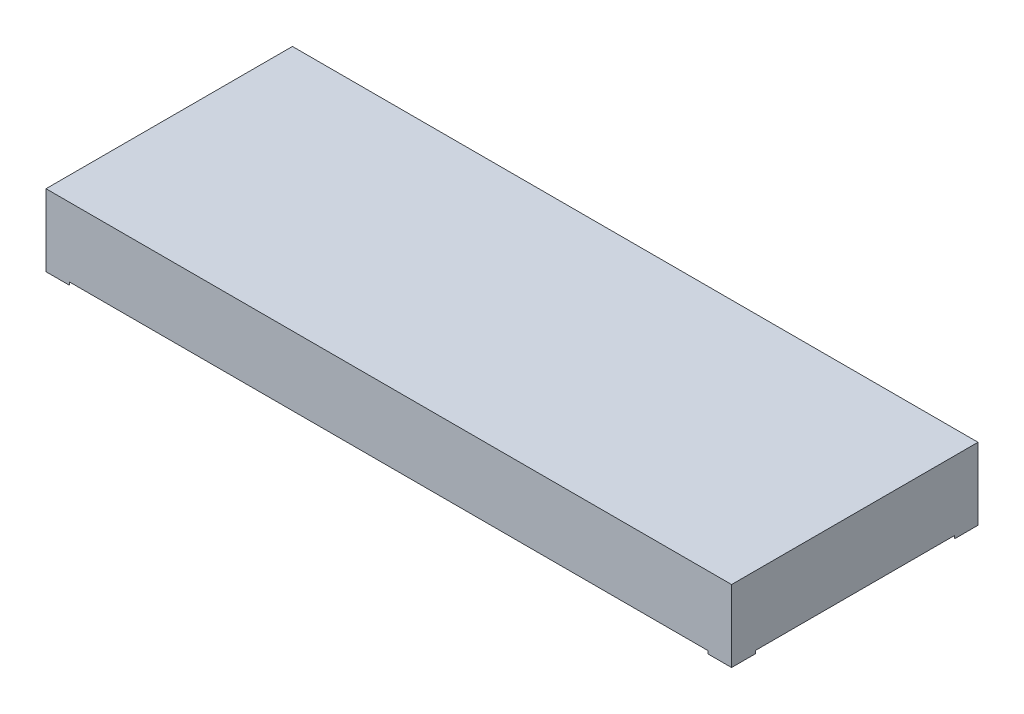
ISO-10303-21;
HEADER;
FILE_DESCRIPTION(('STEP AP214'),'2;1');
FILE_NAME('part.step','',(''),(''),'','','');
FILE_SCHEMA(('AUTOMOTIVE_DESIGN { 1 0 10303 214 1 1 1 1 }'));
ENDSEC;
DATA;
#1=APPLICATION_CONTEXT('core data for automotive mechanical design processes');
#2=APPLICATION_PROTOCOL_DEFINITION('international standard','automotive_design',2000,#1);
#3=PRODUCT_CONTEXT('',#1,'mechanical');
#4=PRODUCT('Part','Part','',(#3));
#5=PRODUCT_RELATED_PRODUCT_CATEGORY('part','',(#4));
#6=PRODUCT_DEFINITION_FORMATION('','',#4);
#7=PRODUCT_DEFINITION_CONTEXT('part definition',#1,'design');
#8=PRODUCT_DEFINITION('design','',#6,#7);
#9=PRODUCT_DEFINITION_SHAPE('','',#8);
#10=(LENGTH_UNIT() NAMED_UNIT(*) SI_UNIT(.MILLI.,.METRE.));
#11=(NAMED_UNIT(*) PLANE_ANGLE_UNIT() SI_UNIT($,.RADIAN.));
#12=(NAMED_UNIT(*) SI_UNIT($,.STERADIAN.) SOLID_ANGLE_UNIT());
#13=UNCERTAINTY_MEASURE_WITH_UNIT(LENGTH_MEASURE(1.E-05),#10,'distance_accuracy_value','');
#14=(GEOMETRIC_REPRESENTATION_CONTEXT(3) GLOBAL_UNCERTAINTY_ASSIGNED_CONTEXT((#13)) GLOBAL_UNIT_ASSIGNED_CONTEXT((#10,
#11,#12)) REPRESENTATION_CONTEXT('',''));
#15=CARTESIAN_POINT('',(0.,0.,0.));
#16=DIRECTION('',(0.,0.,1.));
#17=DIRECTION('',(1.,0.,0.));
#18=AXIS2_PLACEMENT_3D('',#15,#16,#17);
#19=CARTESIAN_POINT('',(0.,7.5,0.));
#20=DIRECTION('',(1.,0.,0.));
#21=DIRECTION('',(0.,0.,-1.));
#22=AXIS2_PLACEMENT_3D('',#19,#20,#21);
#23=PLANE('',#22);
#24=DIRECTION('',(0.,-1.,0.));
#25=VECTOR('',#24,1.);
#26=CARTESIAN_POINT('',(0.,0.3,2.47487373415291));
#27=LINE('',#26,#25);
#28=CARTESIAN_POINT('',(0.,0.3,2.47487373415291));
#29=VERTEX_POINT('',#28);
#30=CARTESIAN_POINT('',(0.,0.,2.47487373415291));
#31=VERTEX_POINT('',#30);
#32=EDGE_CURVE('E234',#29,#31,#27,.T.);
#33=ORIENTED_EDGE('',*,*,#32,.F.);
#34=DIRECTION('',(0.,0.,-1.));
#35=VECTOR('',#34,1.);
#36=CARTESIAN_POINT('',(0.,0.3,0.));
#37=LINE('',#36,#35);
#38=CARTESIAN_POINT('',(0.,0.3,23.2251262658471));
#39=VERTEX_POINT('',#38);
#40=EDGE_CURVE('E168',#39,#29,#37,.T.);
#41=ORIENTED_EDGE('',*,*,#40,.F.);
#42=DIRECTION('',(0.,-1.,0.));
#43=VECTOR('',#42,1.);
#44=CARTESIAN_POINT('',(0.,0.3,23.2251262658471));
#45=LINE('',#44,#43);
#46=CARTESIAN_POINT('',(0.,0.,23.2251262658471));
#47=VERTEX_POINT('',#46);
#48=EDGE_CURVE('E237',#39,#47,#45,.T.);
#49=ORIENTED_EDGE('',*,*,#48,.T.);
#50=DIRECTION('',(0.,0.,1.));
#51=VECTOR('',#50,1.);
#52=CARTESIAN_POINT('',(0.,0.,0.));
#53=LINE('',#52,#51);
#54=CARTESIAN_POINT('',(0.,0.,25.7));
#55=VERTEX_POINT('',#54);
#56=EDGE_CURVE('E188',#47,#55,#53,.T.);
#57=ORIENTED_EDGE('',*,*,#56,.T.);
#58=DIRECTION('',(0.,-1.,0.));
#59=VECTOR('',#58,1.);
#60=CARTESIAN_POINT('',(0.,7.5,25.7));
#61=LINE('',#60,#59);
#62=CARTESIAN_POINT('',(0.,7.5,25.7));
#63=VERTEX_POINT('',#62);
#64=EDGE_CURVE('E11',#63,#55,#61,.T.);
#65=ORIENTED_EDGE('',*,*,#64,.F.);
#66=DIRECTION('',(0.,0.,1.));
#67=VECTOR('',#66,1.);
#68=CARTESIAN_POINT('',(0.,7.5,0.));
#69=LINE('',#68,#67);
#70=CARTESIAN_POINT('',(0.,7.5,0.));
#71=VERTEX_POINT('',#70);
#72=EDGE_CURVE('E172',#71,#63,#69,.T.);
#73=ORIENTED_EDGE('',*,*,#72,.F.);
#74=DIRECTION('',(0.,-1.,0.));
#75=VECTOR('',#74,1.);
#76=CARTESIAN_POINT('',(0.,7.5,0.));
#77=LINE('',#76,#75);
#78=CARTESIAN_POINT('',(0.,0.,0.));
#79=VERTEX_POINT('',#78);
#80=EDGE_CURVE('E182',#71,#79,#77,.T.);
#81=ORIENTED_EDGE('',*,*,#80,.T.);
#82=EDGE_CURVE('E183',#79,#31,#53,.T.);
#83=ORIENTED_EDGE('',*,*,#82,.T.);
#84=EDGE_LOOP('',(#33,#41,#49,#57,#65,#73,#81,#83));
#85=FACE_BOUND('',#84,.T.);
#86=ADVANCED_FACE('F41',(#85),#23,.F.);
#87=CARTESIAN_POINT('',(71.5,7.5,0.));
#88=DIRECTION('',(-1.,0.,0.));
#89=DIRECTION('',(0.,0.,1.));
#90=AXIS2_PLACEMENT_3D('',#87,#88,#89);
#91=PLANE('',#90);
#92=DIRECTION('',(0.,-1.,0.));
#93=VECTOR('',#92,1.);
#94=CARTESIAN_POINT('',(71.5,0.3,23.2251262658471));
#95=LINE('',#94,#93);
#96=CARTESIAN_POINT('',(71.5,0.3,23.2251262658471));
#97=VERTEX_POINT('',#96);
#98=CARTESIAN_POINT('',(71.5,0.,23.2251262658471));
#99=VERTEX_POINT('',#98);
#100=EDGE_CURVE('E166',#97,#99,#95,.T.);
#101=ORIENTED_EDGE('',*,*,#100,.F.);
#102=DIRECTION('',(0.,0.,1.));
#103=VECTOR('',#102,1.);
#104=CARTESIAN_POINT('',(71.5,0.3,0.));
#105=LINE('',#104,#103);
#106=CARTESIAN_POINT('',(71.5,0.3,2.47487373415292));
#107=VERTEX_POINT('',#106);
#108=EDGE_CURVE('E146',#107,#97,#105,.T.);
#109=ORIENTED_EDGE('',*,*,#108,.F.);
#110=DIRECTION('',(0.,-1.,0.));
#111=VECTOR('',#110,1.);
#112=CARTESIAN_POINT('',(71.5,0.3,2.47487373415292));
#113=LINE('',#112,#111);
#114=CARTESIAN_POINT('',(71.5,0.,2.47487373415292));
#115=VERTEX_POINT('',#114);
#116=EDGE_CURVE('E141',#107,#115,#113,.T.);
#117=ORIENTED_EDGE('',*,*,#116,.T.);
#118=DIRECTION('',(0.,0.,-1.));
#119=VECTOR('',#118,1.);
#120=CARTESIAN_POINT('',(71.5,0.,0.));
#121=LINE('',#120,#119);
#122=CARTESIAN_POINT('',(71.5,0.,0.));
#123=VERTEX_POINT('',#122);
#124=EDGE_CURVE('E193',#115,#123,#121,.T.);
#125=ORIENTED_EDGE('',*,*,#124,.T.);
#126=DIRECTION('',(0.,-1.,0.));
#127=VECTOR('',#126,1.);
#128=CARTESIAN_POINT('',(71.5,7.5,0.));
#129=LINE('',#128,#127);
#130=CARTESIAN_POINT('',(71.5,7.5,0.));
#131=VERTEX_POINT('',#130);
#132=EDGE_CURVE('E202',#131,#123,#129,.T.);
#133=ORIENTED_EDGE('',*,*,#132,.F.);
#134=DIRECTION('',(0.,0.,-1.));
#135=VECTOR('',#134,1.);
#136=CARTESIAN_POINT('',(71.5,7.5,0.));
#137=LINE('',#136,#135);
#138=CARTESIAN_POINT('',(71.5,7.5,25.7));
#139=VERTEX_POINT('',#138);
#140=EDGE_CURVE('E177',#139,#131,#137,.T.);
#141=ORIENTED_EDGE('',*,*,#140,.F.);
#142=DIRECTION('',(0.,-1.,0.));
#143=VECTOR('',#142,1.);
#144=CARTESIAN_POINT('',(71.5,7.5,25.7));
#145=LINE('',#144,#143);
#146=CARTESIAN_POINT('',(71.5,0.,25.7));
#147=VERTEX_POINT('',#146);
#148=EDGE_CURVE('E49',#139,#147,#145,.T.);
#149=ORIENTED_EDGE('',*,*,#148,.T.);
#150=EDGE_CURVE('E194',#147,#99,#121,.T.);
#151=ORIENTED_EDGE('',*,*,#150,.T.);
#152=EDGE_LOOP('',(#101,#109,#117,#125,#133,#141,#149,#151));
#153=FACE_BOUND('',#152,.T.);
#154=ADVANCED_FACE('F210',(#153),#91,.F.);
#155=CARTESIAN_POINT('',(0.,7.5,0.));
#156=DIRECTION('',(0.,0.,1.));
#157=DIRECTION('',(1.,0.,0.));
#158=AXIS2_PLACEMENT_3D('',#155,#156,#157);
#159=PLANE('',#158);
#160=DIRECTION('',(0.,-1.,0.));
#161=VECTOR('',#160,1.);
#162=CARTESIAN_POINT('',(2.47487373415292,0.3,0.));
#163=LINE('',#162,#161);
#164=CARTESIAN_POINT('',(2.47487373415292,0.3,0.));
#165=VERTEX_POINT('',#164);
#166=CARTESIAN_POINT('',(2.47487373415292,0.,0.));
#167=VERTEX_POINT('',#166);
#168=EDGE_CURVE('E231',#165,#167,#163,.T.);
#169=ORIENTED_EDGE('',*,*,#168,.T.);
#170=DIRECTION('',(-1.,0.,0.));
#171=VECTOR('',#170,1.);
#172=CARTESIAN_POINT('',(0.,0.,0.));
#173=LINE('',#172,#171);
#174=EDGE_CURVE('E86',#167,#79,#173,.T.);
#175=ORIENTED_EDGE('',*,*,#174,.T.);
#176=ORIENTED_EDGE('',*,*,#80,.F.);
#177=DIRECTION('',(-1.,0.,0.));
#178=VECTOR('',#177,1.);
#179=CARTESIAN_POINT('',(0.,7.5,0.));
#180=LINE('',#179,#178);
#181=EDGE_CURVE('E65',#131,#71,#180,.T.);
#182=ORIENTED_EDGE('',*,*,#181,.F.);
#183=ORIENTED_EDGE('',*,*,#132,.T.);
#184=CARTESIAN_POINT('',(69.0251262658471,0.,0.));
#185=VERTEX_POINT('',#184);
#186=EDGE_CURVE('E161',#123,#185,#173,.T.);
#187=ORIENTED_EDGE('',*,*,#186,.T.);
#188=DIRECTION('',(0.,-1.,0.));
#189=VECTOR('',#188,1.);
#190=CARTESIAN_POINT('',(69.0251262658471,0.3,0.));
#191=LINE('',#190,#189);
#192=CARTESIAN_POINT('',(69.0251262658471,0.3,0.));
#193=VERTEX_POINT('',#192);
#194=EDGE_CURVE('E56',#193,#185,#191,.T.);
#195=ORIENTED_EDGE('',*,*,#194,.F.);
#196=DIRECTION('',(1.,0.,0.));
#197=VECTOR('',#196,1.);
#198=CARTESIAN_POINT('',(0.,0.3,0.));
#199=LINE('',#198,#197);
#200=EDGE_CURVE('E147',#165,#193,#199,.T.);
#201=ORIENTED_EDGE('',*,*,#200,.F.);
#202=EDGE_LOOP('',(#169,#175,#176,#182,#183,#187,#195,#201));
#203=FACE_BOUND('',#202,.T.);
#204=ADVANCED_FACE('F158',(#203),#159,.F.);
#205=CARTESIAN_POINT('',(0.,0.,0.));
#206=DIRECTION('',(0.,1.,0.));
#207=DIRECTION('',(0.,0.,1.));
#208=AXIS2_PLACEMENT_3D('',#205,#206,#207);
#209=PLANE('',#208);
#210=DIRECTION('',(-0.707106781186547,0.,0.707106781186548));
#211=VECTOR('',#210,1.);
#212=CARTESIAN_POINT('',(1.23743686707646,0.,1.23743686707645));
#213=LINE('',#212,#211);
#214=EDGE_CURVE('E155',#167,#31,#213,.T.);
#215=ORIENTED_EDGE('',*,*,#214,.T.);
#216=ORIENTED_EDGE('',*,*,#82,.F.);
#217=ORIENTED_EDGE('',*,*,#174,.F.);
#218=EDGE_LOOP('',(#215,#216,#217));
#219=FACE_BOUND('',#218,.T.);
#220=ADVANCED_FACE('F272',(#219),#209,.F.);
#221=DIRECTION('',(0.707106781186546,0.,-0.707106781186549));
#222=VECTOR('',#221,1.);
#223=CARTESIAN_POINT('',(47.3625631329237,0.,47.3625631329235));
#224=LINE('',#223,#222);
#225=CARTESIAN_POINT('',(69.0251262658471,0.,25.7));
#226=VERTEX_POINT('',#225);
#227=EDGE_CURVE('E216',#226,#99,#224,.T.);
#228=ORIENTED_EDGE('',*,*,#227,.T.);
#229=ORIENTED_EDGE('',*,*,#150,.F.);
#230=DIRECTION('',(1.,0.,0.));
#231=VECTOR('',#230,1.);
#232=CARTESIAN_POINT('',(0.,0.,25.7));
#233=LINE('',#232,#231);
#234=EDGE_CURVE('E187',#226,#147,#233,.T.);
#235=ORIENTED_EDGE('',*,*,#234,.F.);
#236=EDGE_LOOP('',(#228,#229,#235));
#237=FACE_BOUND('',#236,.T.);
#238=ADVANCED_FACE('F215',(#237),#209,.F.);
#239=ORIENTED_EDGE('',*,*,#56,.F.);
#240=DIRECTION('',(-0.707106781186547,0.,-0.707106781186548));
#241=VECTOR('',#240,1.);
#242=CARTESIAN_POINT('',(-11.6125631329235,0.,11.6125631329235));
#243=LINE('',#242,#241);
#244=CARTESIAN_POINT('',(2.47487373415292,0.,25.7));
#245=VERTEX_POINT('',#244);
#246=EDGE_CURVE('E220',#245,#47,#243,.T.);
#247=ORIENTED_EDGE('',*,*,#246,.F.);
#248=EDGE_CURVE('E189',#55,#245,#233,.T.);
#249=ORIENTED_EDGE('',*,*,#248,.F.);
#250=EDGE_LOOP('',(#239,#247,#249));
#251=FACE_BOUND('',#250,.T.);
#252=ADVANCED_FACE('F283',(#251),#209,.F.);
#253=CARTESIAN_POINT('',(0.,7.5,25.7));
#254=DIRECTION('',(0.,0.,-1.));
#255=DIRECTION('',(-1.,0.,0.));
#256=AXIS2_PLACEMENT_3D('',#253,#254,#255);
#257=PLANE('',#256);
#258=ORIENTED_EDGE('',*,*,#248,.T.);
#259=DIRECTION('',(0.,-1.,0.));
#260=VECTOR('',#259,1.);
#261=CARTESIAN_POINT('',(2.47487373415292,0.3,25.7));
#262=LINE('',#261,#260);
#263=CARTESIAN_POINT('',(2.47487373415292,0.3,25.7));
#264=VERTEX_POINT('',#263);
#265=EDGE_CURVE('E241',#264,#245,#262,.T.);
#266=ORIENTED_EDGE('',*,*,#265,.F.);
#267=DIRECTION('',(-1.,0.,0.));
#268=VECTOR('',#267,1.);
#269=CARTESIAN_POINT('',(0.,0.3,25.7));
#270=LINE('',#269,#268);
#271=CARTESIAN_POINT('',(69.0251262658471,0.3,25.7));
#272=VERTEX_POINT('',#271);
#273=EDGE_CURVE('E254',#272,#264,#270,.T.);
#274=ORIENTED_EDGE('',*,*,#273,.F.);
#275=DIRECTION('',(0.,-1.,0.));
#276=VECTOR('',#275,1.);
#277=CARTESIAN_POINT('',(69.0251262658471,0.3,25.7));
#278=LINE('',#277,#276);
#279=EDGE_CURVE('E244',#272,#226,#278,.T.);
#280=ORIENTED_EDGE('',*,*,#279,.T.);
#281=ORIENTED_EDGE('',*,*,#234,.T.);
#282=ORIENTED_EDGE('',*,*,#148,.F.);
#283=DIRECTION('',(1.,0.,0.));
#284=VECTOR('',#283,1.);
#285=CARTESIAN_POINT('',(0.,7.5,25.7));
#286=LINE('',#285,#284);
#287=EDGE_CURVE('E93',#63,#139,#286,.T.);
#288=ORIENTED_EDGE('',*,*,#287,.F.);
#289=ORIENTED_EDGE('',*,*,#64,.T.);
#290=EDGE_LOOP('',(#258,#266,#274,#280,#281,#282,#288,#289));
#291=FACE_BOUND('',#290,.T.);
#292=ADVANCED_FACE('F285',(#291),#257,.F.);
#293=CARTESIAN_POINT('',(0.,7.5,0.));
#294=DIRECTION('',(0.,1.,0.));
#295=DIRECTION('',(0.,0.,1.));
#296=AXIS2_PLACEMENT_3D('',#293,#294,#295);
#297=PLANE('',#296);
#298=ORIENTED_EDGE('',*,*,#72,.T.);
#299=ORIENTED_EDGE('',*,*,#287,.T.);
#300=ORIENTED_EDGE('',*,*,#140,.T.);
#301=ORIENTED_EDGE('',*,*,#181,.T.);
#302=EDGE_LOOP('',(#298,#299,#300,#301));
#303=FACE_BOUND('',#302,.T.);
#304=ADVANCED_FACE('F287',(#303),#297,.T.);
#305=ORIENTED_EDGE('',*,*,#124,.F.);
#306=DIRECTION('',(0.707106781186546,0.,0.707106781186549));
#307=VECTOR('',#306,1.);
#308=CARTESIAN_POINT('',(34.5125631329237,0.,-34.5125631329236));
#309=LINE('',#308,#307);
#310=EDGE_CURVE('E221',#185,#115,#309,.T.);
#311=ORIENTED_EDGE('',*,*,#310,.F.);
#312=ORIENTED_EDGE('',*,*,#186,.F.);
#313=EDGE_LOOP('',(#305,#311,#312));
#314=FACE_BOUND('',#313,.T.);
#315=ADVANCED_FACE('F292',(#314),#209,.F.);
#316=CARTESIAN_POINT('',(1.23743686707646,0.3,1.23743686707645));
#317=DIRECTION('',(0.707106781186548,0.,0.707106781186547));
#318=DIRECTION('',(0.707106781186547,0.,-0.707106781186548));
#319=AXIS2_PLACEMENT_3D('',#316,#317,#318);
#320=PLANE('',#319);
#321=ORIENTED_EDGE('',*,*,#214,.F.);
#322=ORIENTED_EDGE('',*,*,#168,.F.);
#323=DIRECTION('',(-0.707106781186547,0.,0.707106781186548));
#324=VECTOR('',#323,1.);
#325=CARTESIAN_POINT('',(1.23743686707646,0.3,1.23743686707645));
#326=LINE('',#325,#324);
#327=EDGE_CURVE('E153',#165,#29,#326,.T.);
#328=ORIENTED_EDGE('',*,*,#327,.T.);
#329=ORIENTED_EDGE('',*,*,#32,.T.);
#330=EDGE_LOOP('',(#321,#322,#328,#329));
#331=FACE_BOUND('',#330,.T.);
#332=ADVANCED_FACE('F270',(#331),#320,.T.);
#333=CARTESIAN_POINT('',(-11.6125631329235,0.3,11.6125631329235));
#334=DIRECTION('',(-0.707106781186548,0.,0.707106781186547));
#335=DIRECTION('',(0.707106781186547,0.,0.707106781186548));
#336=AXIS2_PLACEMENT_3D('',#333,#334,#335);
#337=PLANE('',#336);
#338=ORIENTED_EDGE('',*,*,#246,.T.);
#339=ORIENTED_EDGE('',*,*,#48,.F.);
#340=DIRECTION('',(-0.707106781186547,0.,-0.707106781186548));
#341=VECTOR('',#340,1.);
#342=CARTESIAN_POINT('',(-11.6125631329235,0.3,11.6125631329235));
#343=LINE('',#342,#341);
#344=EDGE_CURVE('E260',#264,#39,#343,.T.);
#345=ORIENTED_EDGE('',*,*,#344,.F.);
#346=ORIENTED_EDGE('',*,*,#265,.T.);
#347=EDGE_LOOP('',(#338,#339,#345,#346));
#348=FACE_BOUND('',#347,.T.);
#349=ADVANCED_FACE('F311',(#348),#337,.F.);
#350=CARTESIAN_POINT('',(47.3625631329237,0.3,47.3625631329235));
#351=DIRECTION('',(-0.707106781186549,0.,-0.707106781186546));
#352=DIRECTION('',(-0.707106781186546,0.,0.707106781186549));
#353=AXIS2_PLACEMENT_3D('',#350,#351,#352);
#354=PLANE('',#353);
#355=ORIENTED_EDGE('',*,*,#227,.F.);
#356=ORIENTED_EDGE('',*,*,#279,.F.);
#357=DIRECTION('',(0.707106781186546,0.,-0.707106781186549));
#358=VECTOR('',#357,1.);
#359=CARTESIAN_POINT('',(47.3625631329237,0.3,47.3625631329235));
#360=LINE('',#359,#358);
#361=EDGE_CURVE('E249',#272,#97,#360,.T.);
#362=ORIENTED_EDGE('',*,*,#361,.T.);
#363=ORIENTED_EDGE('',*,*,#100,.T.);
#364=EDGE_LOOP('',(#355,#356,#362,#363));
#365=FACE_BOUND('',#364,.T.);
#366=ADVANCED_FACE('F247',(#365),#354,.T.);
#367=CARTESIAN_POINT('',(34.5125631329237,0.3,-34.5125631329236));
#368=DIRECTION('',(0.707106781186549,0.,-0.707106781186546));
#369=DIRECTION('',(-0.707106781186546,0.,-0.707106781186549));
#370=AXIS2_PLACEMENT_3D('',#367,#368,#369);
#371=PLANE('',#370);
#372=ORIENTED_EDGE('',*,*,#310,.T.);
#373=ORIENTED_EDGE('',*,*,#116,.F.);
#374=DIRECTION('',(0.707106781186546,0.,0.707106781186549));
#375=VECTOR('',#374,1.);
#376=CARTESIAN_POINT('',(34.5125631329237,0.3,-34.5125631329236));
#377=LINE('',#376,#375);
#378=EDGE_CURVE('E137',#193,#107,#377,.T.);
#379=ORIENTED_EDGE('',*,*,#378,.F.);
#380=ORIENTED_EDGE('',*,*,#194,.T.);
#381=EDGE_LOOP('',(#372,#373,#379,#380));
#382=FACE_BOUND('',#381,.T.);
#383=ADVANCED_FACE('F139',(#382),#371,.F.);
#384=CARTESIAN_POINT('',(0.,0.3,0.));
#385=DIRECTION('',(0.,-1.,0.));
#386=DIRECTION('',(0.,0.,-1.));
#387=AXIS2_PLACEMENT_3D('',#384,#385,#386);
#388=PLANE('',#387);
#389=ORIENTED_EDGE('',*,*,#200,.T.);
#390=ORIENTED_EDGE('',*,*,#378,.T.);
#391=ORIENTED_EDGE('',*,*,#108,.T.);
#392=ORIENTED_EDGE('',*,*,#361,.F.);
#393=ORIENTED_EDGE('',*,*,#273,.T.);
#394=ORIENTED_EDGE('',*,*,#344,.T.);
#395=ORIENTED_EDGE('',*,*,#40,.T.);
#396=ORIENTED_EDGE('',*,*,#327,.F.);
#397=EDGE_LOOP('',(#389,#390,#391,#392,#393,#394,#395,#396));
#398=FACE_BOUND('',#397,.T.);
#399=ADVANCED_FACE('F151',(#398),#388,.T.);
#400=CLOSED_SHELL('',(#86,#154,#204,#220,#238,#252,#292,#304,#315,#332,#349,#366,#383,#399));
#401=MANIFOLD_SOLID_BREP('B2',#400);
#402=ADVANCED_BREP_SHAPE_REPRESENTATION('',(#18,#401),#14);
#403=SHAPE_DEFINITION_REPRESENTATION(#9,#402);
ENDSEC;
END-ISO-10303-21;
